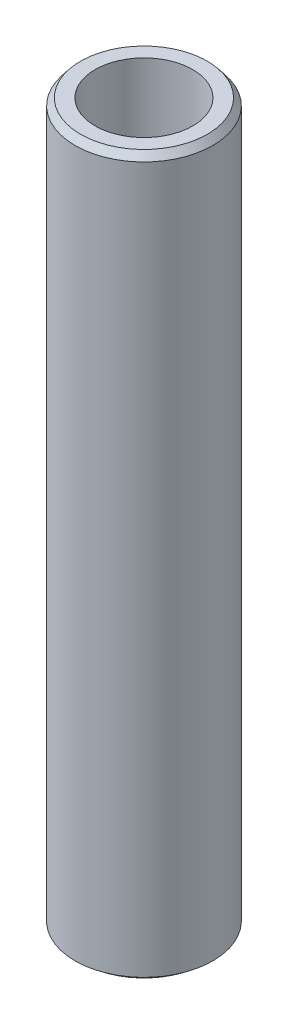
ISO-10303-21;
HEADER;
FILE_DESCRIPTION(('STEP AP214'),'2;1');
FILE_NAME('part.step','',(''),(''),'','','');
FILE_SCHEMA(('AUTOMOTIVE_DESIGN { 1 0 10303 214 1 1 1 1 }'));
ENDSEC;
DATA;
#1=APPLICATION_CONTEXT('core data for automotive mechanical design processes');
#2=APPLICATION_PROTOCOL_DEFINITION('international standard','automotive_design',2000,#1);
#3=PRODUCT_CONTEXT('',#1,'mechanical');
#4=PRODUCT('Part','Part','',(#3));
#5=PRODUCT_RELATED_PRODUCT_CATEGORY('part','',(#4));
#6=PRODUCT_DEFINITION_FORMATION('','',#4);
#7=PRODUCT_DEFINITION_CONTEXT('part definition',#1,'design');
#8=PRODUCT_DEFINITION('design','',#6,#7);
#9=PRODUCT_DEFINITION_SHAPE('','',#8);
#10=(LENGTH_UNIT() NAMED_UNIT(*) SI_UNIT(.MILLI.,.METRE.));
#11=(NAMED_UNIT(*) PLANE_ANGLE_UNIT() SI_UNIT($,.RADIAN.));
#12=(NAMED_UNIT(*) SI_UNIT($,.STERADIAN.) SOLID_ANGLE_UNIT());
#13=UNCERTAINTY_MEASURE_WITH_UNIT(LENGTH_MEASURE(1.E-05),#10,'distance_accuracy_value','');
#14=(GEOMETRIC_REPRESENTATION_CONTEXT(3) GLOBAL_UNCERTAINTY_ASSIGNED_CONTEXT((#13)) GLOBAL_UNIT_ASSIGNED_CONTEXT((#10,
#11,#12)) REPRESENTATION_CONTEXT('',''));
#15=CARTESIAN_POINT('',(0.,0.,0.));
#16=DIRECTION('',(0.,0.,1.));
#17=DIRECTION('',(1.,0.,0.));
#18=AXIS2_PLACEMENT_3D('',#15,#16,#17);
#19=CARTESIAN_POINT('',(0.,600.,0.));
#20=DIRECTION('',(0.,-1.,0.));
#21=DIRECTION('',(0.,0.,-1.));
#22=AXIS2_PLACEMENT_3D('',#19,#20,#21);
#23=CYLINDRICAL_SURFACE('',#22,57.5);
#24=CARTESIAN_POINT('',(0.,594.18983546566,0.));
#25=DIRECTION('',(0.,1.,0.));
#26=DIRECTION('',(0.,0.,1.));
#27=AXIS2_PLACEMENT_3D('',#24,#25,#26);
#28=CIRCLE('',#27,57.5);
#29=CARTESIAN_POINT('',(0.,594.18983546566,57.5));
#30=VERTEX_POINT('',#29);
#31=EDGE_CURVE('E50',#30,#30,#28,.F.);
#32=ORIENTED_EDGE('',*,*,#31,.T.);
#33=EDGE_LOOP('',(#32));
#34=FACE_BOUND('',#33,.T.);
#35=CARTESIAN_POINT('',(0.,4.58673978636714,0.));
#36=DIRECTION('',(0.,1.,0.));
#37=DIRECTION('',(0.,0.,1.));
#38=AXIS2_PLACEMENT_3D('',#35,#36,#37);
#39=CIRCLE('',#38,57.5);
#40=CARTESIAN_POINT('',(0.,4.58673978636714,57.5));
#41=VERTEX_POINT('',#40);
#42=EDGE_CURVE('E51',#41,#41,#39,.T.);
#43=ORIENTED_EDGE('',*,*,#42,.T.);
#44=EDGE_LOOP('',(#43));
#45=FACE_BOUND('',#44,.T.);
#46=ADVANCED_FACE('F39',(#34,#45),#23,.T.);
#47=CARTESIAN_POINT('',(0.,600.,0.));
#48=DIRECTION('',(0.,1.,0.));
#49=DIRECTION('',(0.,0.,1.));
#50=AXIS2_PLACEMENT_3D('',#47,#48,#49);
#51=PLANE('',#50);
#52=CARTESIAN_POINT('',(0.,600.,0.));
#53=DIRECTION('',(0.,1.,0.));
#54=DIRECTION('',(0.,0.,1.));
#55=AXIS2_PLACEMENT_3D('',#52,#53,#54);
#56=CIRCLE('',#55,52.9132602136328);
#57=CARTESIAN_POINT('',(0.,600.,52.9132602136328));
#58=VERTEX_POINT('',#57);
#59=EDGE_CURVE('E54',#58,#58,#56,.T.);
#60=ORIENTED_EDGE('',*,*,#59,.T.);
#61=EDGE_LOOP('',(#60));
#62=FACE_BOUND('',#61,.T.);
#63=CARTESIAN_POINT('',(0.,600.,0.));
#64=DIRECTION('',(0.,1.,0.));
#65=DIRECTION('',(0.,0.,1.));
#66=AXIS2_PLACEMENT_3D('',#63,#64,#65);
#67=CIRCLE('',#66,40.7664165121148);
#68=CARTESIAN_POINT('',(0.,600.,40.7664165121148));
#69=VERTEX_POINT('',#68);
#70=EDGE_CURVE('E58',#69,#69,#67,.T.);
#71=ORIENTED_EDGE('',*,*,#70,.F.);
#72=EDGE_LOOP('',(#71));
#73=FACE_BOUND('',#72,.T.);
#74=ADVANCED_FACE('F69',(#62,#73),#51,.T.);
#75=CARTESIAN_POINT('',(0.,0.,0.));
#76=DIRECTION('',(0.,1.,0.));
#77=DIRECTION('',(0.,0.,1.));
#78=AXIS2_PLACEMENT_3D('',#75,#76,#77);
#79=PLANE('',#78);
#80=CARTESIAN_POINT('',(0.,0.,0.));
#81=DIRECTION('',(0.,1.,0.));
#82=DIRECTION('',(0.,0.,1.));
#83=AXIS2_PLACEMENT_3D('',#80,#81,#82);
#84=CIRCLE('',#83,51.6898354656597);
#85=CARTESIAN_POINT('',(0.,0.,51.6898354656597));
#86=VERTEX_POINT('',#85);
#87=EDGE_CURVE('E10',#86,#86,#84,.F.);
#88=ORIENTED_EDGE('',*,*,#87,.T.);
#89=EDGE_LOOP('',(#88));
#90=FACE_BOUND('',#89,.T.);
#91=CARTESIAN_POINT('',(0.,0.,0.));
#92=DIRECTION('',(0.,1.,0.));
#93=DIRECTION('',(0.,0.,1.));
#94=AXIS2_PLACEMENT_3D('',#91,#92,#93);
#95=CIRCLE('',#94,40.7664165121148);
#96=CARTESIAN_POINT('',(0.,0.,40.7664165121148));
#97=VERTEX_POINT('',#96);
#98=EDGE_CURVE('E63',#97,#97,#95,.T.);
#99=ORIENTED_EDGE('',*,*,#98,.T.);
#100=EDGE_LOOP('',(#99));
#101=FACE_BOUND('',#100,.T.);
#102=ADVANCED_FACE('F75',(#90,#101),#79,.F.);
#103=CARTESIAN_POINT('',(0.,600.,0.));
#104=DIRECTION('',(0.,-1.,0.));
#105=DIRECTION('',(0.,0.,-1.));
#106=AXIS2_PLACEMENT_3D('',#103,#104,#105);
#107=CYLINDRICAL_SURFACE('',#106,40.7664165121148);
#108=ORIENTED_EDGE('',*,*,#70,.T.);
#109=EDGE_LOOP('',(#108));
#110=FACE_BOUND('',#109,.T.);
#111=ORIENTED_EDGE('',*,*,#98,.F.);
#112=EDGE_LOOP('',(#111));
#113=FACE_BOUND('',#112,.T.);
#114=ADVANCED_FACE('F70',(#110,#113),#107,.F.);
#115=CARTESIAN_POINT('',(0.,600.,0.));
#116=DIRECTION('',(0.,-1.,0.));
#117=DIRECTION('',(0.,0.,-1.));
#118=AXIS2_PLACEMENT_3D('',#115,#116,#117);
#119=CONICAL_SURFACE('',#118,52.9132602136328,0.668264797087474);
#120=ORIENTED_EDGE('',*,*,#31,.F.);
#121=EDGE_LOOP('',(#120));
#122=FACE_BOUND('',#121,.T.);
#123=ORIENTED_EDGE('',*,*,#59,.F.);
#124=EDGE_LOOP('',(#123));
#125=FACE_BOUND('',#124,.T.);
#126=ADVANCED_FACE('F81',(#122,#125),#119,.T.);
#127=CARTESIAN_POINT('',(0.,4.58673978636714,0.));
#128=DIRECTION('',(0.,1.,0.));
#129=DIRECTION('',(0.,0.,1.));
#130=AXIS2_PLACEMENT_3D('',#127,#128,#129);
#131=CONICAL_SURFACE('',#130,57.5,0.902531529707439);
#132=ORIENTED_EDGE('',*,*,#87,.F.);
#133=EDGE_LOOP('',(#132));
#134=FACE_BOUND('',#133,.T.);
#135=ORIENTED_EDGE('',*,*,#42,.F.);
#136=EDGE_LOOP('',(#135));
#137=FACE_BOUND('',#136,.T.);
#138=ADVANCED_FACE('F45',(#134,#137),#131,.T.);
#139=CLOSED_SHELL('',(#46,#74,#102,#114,#126,#138));
#140=MANIFOLD_SOLID_BREP('B2',#139);
#141=ADVANCED_BREP_SHAPE_REPRESENTATION('',(#18,#140),#14);
#142=SHAPE_DEFINITION_REPRESENTATION(#9,#141);
ENDSEC;
END-ISO-10303-21;
